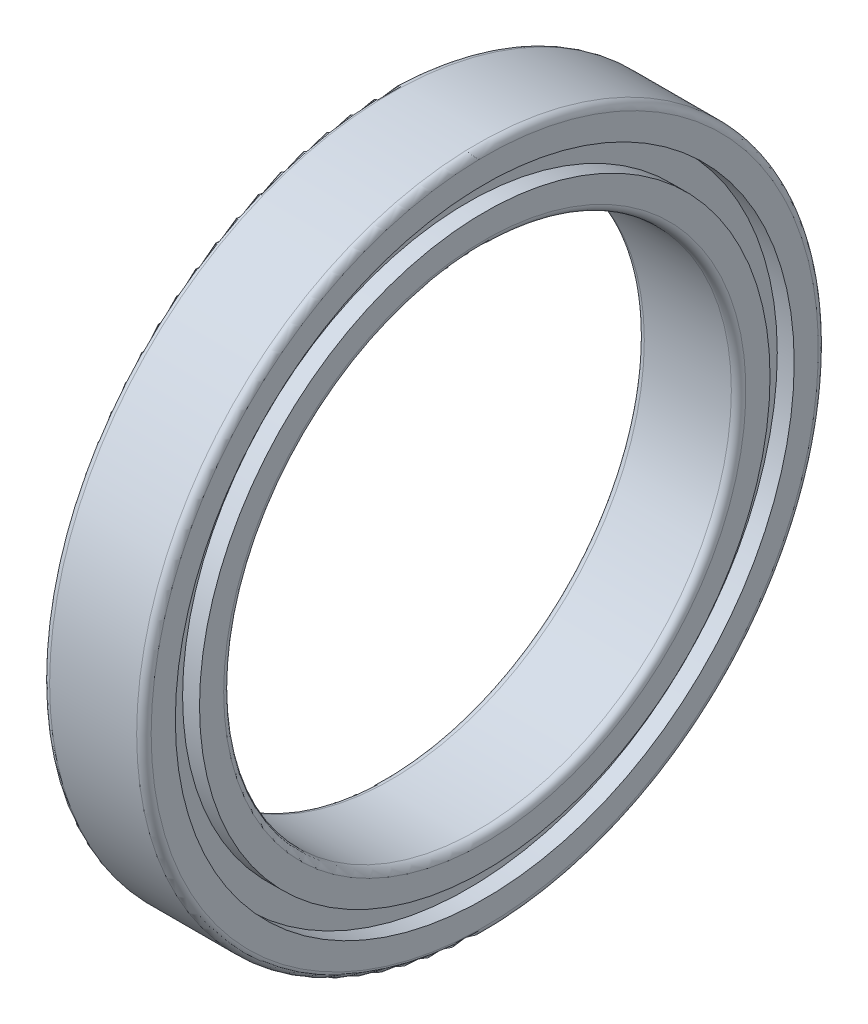
ISO-10303-21;
HEADER;
FILE_DESCRIPTION(('STEP AP214'),'2;1');
FILE_NAME('part.step','',(''),(''),'','','');
FILE_SCHEMA(('AUTOMOTIVE_DESIGN { 1 0 10303 214 1 1 1 1 }'));
ENDSEC;
DATA;
#1=APPLICATION_CONTEXT('core data for automotive mechanical design processes');
#2=APPLICATION_PROTOCOL_DEFINITION('international standard','automotive_design',2000,#1);
#3=PRODUCT_CONTEXT('',#1,'mechanical');
#4=PRODUCT('Part','Part','',(#3));
#5=PRODUCT_RELATED_PRODUCT_CATEGORY('part','',(#4));
#6=PRODUCT_DEFINITION_FORMATION('','',#4);
#7=PRODUCT_DEFINITION_CONTEXT('part definition',#1,'design');
#8=PRODUCT_DEFINITION('design','',#6,#7);
#9=PRODUCT_DEFINITION_SHAPE('','',#8);
#10=(LENGTH_UNIT() NAMED_UNIT(*) SI_UNIT(.MILLI.,.METRE.));
#11=(NAMED_UNIT(*) PLANE_ANGLE_UNIT() SI_UNIT($,.RADIAN.));
#12=(NAMED_UNIT(*) SI_UNIT($,.STERADIAN.) SOLID_ANGLE_UNIT());
#13=UNCERTAINTY_MEASURE_WITH_UNIT(LENGTH_MEASURE(1.E-05),#10,'distance_accuracy_value','');
#14=(GEOMETRIC_REPRESENTATION_CONTEXT(3) GLOBAL_UNCERTAINTY_ASSIGNED_CONTEXT((#13)) GLOBAL_UNIT_ASSIGNED_CONTEXT((#10,
#11,#12)) REPRESENTATION_CONTEXT('',''));
#15=CARTESIAN_POINT('',(0.,0.,0.));
#16=DIRECTION('',(0.,0.,1.));
#17=DIRECTION('',(1.,0.,0.));
#18=AXIS2_PLACEMENT_3D('',#15,#16,#17);
#19=CARTESIAN_POINT('',(-3.,0.,0.));
#20=DIRECTION('',(-1.,0.,0.));
#21=DIRECTION('',(0.,0.,1.));
#22=AXIS2_PLACEMENT_3D('',#19,#20,#21);
#23=TOROIDAL_SURFACE('',#22,18.,0.5);
#24=CARTESIAN_POINT('',(-3.,0.,0.));
#25=DIRECTION('',(-1.,0.,0.));
#26=DIRECTION('',(0.,0.,1.));
#27=AXIS2_PLACEMENT_3D('',#24,#25,#26);
#28=CIRCLE('',#27,17.5);
#29=CARTESIAN_POINT('',(-3.,0.,17.5));
#30=VERTEX_POINT('',#29);
#31=EDGE_CURVE('E94',#30,#30,#28,.T.);
#32=ORIENTED_EDGE('',*,*,#31,.F.);
#33=EDGE_LOOP('',(#32));
#34=FACE_BOUND('',#33,.T.);
#35=CARTESIAN_POINT('',(-3.49999999999995,0.,0.));
#36=DIRECTION('',(-1.,0.,0.));
#37=DIRECTION('',(0.,0.,1.));
#38=AXIS2_PLACEMENT_3D('',#35,#36,#37);
#39=CIRCLE('',#38,18.);
#40=CARTESIAN_POINT('',(-3.49999999999995,0.,18.));
#41=VERTEX_POINT('',#40);
#42=EDGE_CURVE('E12',#41,#41,#39,.T.);
#43=ORIENTED_EDGE('',*,*,#42,.T.);
#44=EDGE_LOOP('',(#43));
#45=FACE_BOUND('',#44,.T.);
#46=ADVANCED_FACE('F42',(#34,#45),#23,.T.);
#47=CARTESIAN_POINT('',(-3.5,18.,0.));
#48=DIRECTION('',(1.,0.,0.));
#49=DIRECTION('',(0.,0.,-1.));
#50=AXIS2_PLACEMENT_3D('',#47,#48,#49);
#51=PLANE('',#50);
#52=ORIENTED_EDGE('',*,*,#42,.F.);
#53=EDGE_LOOP('',(#52));
#54=FACE_BOUND('',#53,.T.);
#55=CARTESIAN_POINT('',(-3.49999999999995,0.,0.));
#56=DIRECTION('',(-1.,0.,0.));
#57=DIRECTION('',(0.,0.,1.));
#58=AXIS2_PLACEMENT_3D('',#55,#56,#57);
#59=CIRCLE('',#58,19.6666666666667);
#60=CARTESIAN_POINT('',(-3.49999999999995,0.,19.6666666666667));
#61=VERTEX_POINT('',#60);
#62=EDGE_CURVE('E48',#61,#61,#59,.T.);
#63=ORIENTED_EDGE('',*,*,#62,.T.);
#64=EDGE_LOOP('',(#63));
#65=FACE_BOUND('',#64,.T.);
#66=ADVANCED_FACE('F101',(#54,#65),#51,.F.);
#67=CARTESIAN_POINT('',(-1000.,0.,0.));
#68=DIRECTION('',(-1.,0.,0.));
#69=DIRECTION('',(0.,0.,1.));
#70=AXIS2_PLACEMENT_3D('',#67,#68,#69);
#71=CYLINDRICAL_SURFACE('',#70,19.6666666666667);
#72=ORIENTED_EDGE('',*,*,#62,.F.);
#73=EDGE_LOOP('',(#72));
#74=FACE_BOUND('',#73,.T.);
#75=CARTESIAN_POINT('',(-2.3333333333333,0.,0.));
#76=DIRECTION('',(-1.,0.,0.));
#77=DIRECTION('',(0.,0.,1.));
#78=AXIS2_PLACEMENT_3D('',#75,#76,#77);
#79=CIRCLE('',#78,19.6666666666667);
#80=CARTESIAN_POINT('',(-2.3333333333333,0.,19.6666666666667));
#81=VERTEX_POINT('',#80);
#82=EDGE_CURVE('E52',#81,#81,#79,.T.);
#83=ORIENTED_EDGE('',*,*,#82,.T.);
#84=EDGE_LOOP('',(#83));
#85=FACE_BOUND('',#84,.T.);
#86=ADVANCED_FACE('F105',(#74,#85),#71,.T.);
#87=CARTESIAN_POINT('',(-2.33333333333333,19.6666666666667,0.));
#88=DIRECTION('',(1.,0.,0.));
#89=DIRECTION('',(0.,0.,-1.));
#90=AXIS2_PLACEMENT_3D('',#87,#88,#89);
#91=PLANE('',#90);
#92=ORIENTED_EDGE('',*,*,#82,.F.);
#93=EDGE_LOOP('',(#92));
#94=FACE_BOUND('',#93,.T.);
#95=CARTESIAN_POINT('',(-2.3333333333333,0.,0.));
#96=DIRECTION('',(-1.,0.,0.));
#97=DIRECTION('',(0.,0.,1.));
#98=AXIS2_PLACEMENT_3D('',#95,#96,#97);
#99=CIRCLE('',#98,21.3333333333333);
#100=CARTESIAN_POINT('',(-2.3333333333333,0.,21.3333333333333));
#101=VERTEX_POINT('',#100);
#102=EDGE_CURVE('E56',#101,#101,#99,.T.);
#103=ORIENTED_EDGE('',*,*,#102,.T.);
#104=EDGE_LOOP('',(#103));
#105=FACE_BOUND('',#104,.T.);
#106=ADVANCED_FACE('F110',(#94,#105),#91,.F.);
#107=CARTESIAN_POINT('',(-1000.,0.,0.));
#108=DIRECTION('',(-1.,0.,0.));
#109=DIRECTION('',(0.,0.,1.));
#110=AXIS2_PLACEMENT_3D('',#107,#108,#109);
#111=CYLINDRICAL_SURFACE('',#110,21.3333333333333);
#112=ORIENTED_EDGE('',*,*,#102,.F.);
#113=EDGE_LOOP('',(#112));
#114=FACE_BOUND('',#113,.T.);
#115=CARTESIAN_POINT('',(-3.49999999999995,0.,0.));
#116=DIRECTION('',(-1.,0.,0.));
#117=DIRECTION('',(0.,0.,1.));
#118=AXIS2_PLACEMENT_3D('',#115,#116,#117);
#119=CIRCLE('',#118,21.3333333333333);
#120=CARTESIAN_POINT('',(-3.49999999999995,0.,21.3333333333333));
#121=VERTEX_POINT('',#120);
#122=EDGE_CURVE('E61',#121,#121,#119,.T.);
#123=ORIENTED_EDGE('',*,*,#122,.T.);
#124=EDGE_LOOP('',(#123));
#125=FACE_BOUND('',#124,.T.);
#126=ADVANCED_FACE('F116',(#114,#125),#111,.F.);
#127=CARTESIAN_POINT('',(-3.5,21.3333333333333,0.));
#128=DIRECTION('',(1.,0.,0.));
#129=DIRECTION('',(0.,0.,-1.));
#130=AXIS2_PLACEMENT_3D('',#127,#128,#129);
#131=PLANE('',#130);
#132=ORIENTED_EDGE('',*,*,#122,.F.);
#133=EDGE_LOOP('',(#132));
#134=FACE_BOUND('',#133,.T.);
#135=CARTESIAN_POINT('',(-3.49999999999995,0.,0.));
#136=DIRECTION('',(-1.,0.,0.));
#137=DIRECTION('',(0.,0.,1.));
#138=AXIS2_PLACEMENT_3D('',#135,#136,#137);
#139=CIRCLE('',#138,23.);
#140=CARTESIAN_POINT('',(-3.49999999999995,0.,23.));
#141=VERTEX_POINT('',#140);
#142=EDGE_CURVE('E64',#141,#141,#139,.T.);
#143=ORIENTED_EDGE('',*,*,#142,.T.);
#144=EDGE_LOOP('',(#143));
#145=FACE_BOUND('',#144,.T.);
#146=ADVANCED_FACE('F120',(#134,#145),#131,.F.);
#147=CARTESIAN_POINT('',(-3.,0.,0.));
#148=DIRECTION('',(-1.,0.,0.));
#149=DIRECTION('',(0.,0.,1.));
#150=AXIS2_PLACEMENT_3D('',#147,#148,#149);
#151=TOROIDAL_SURFACE('',#150,23.,0.5);
#152=ORIENTED_EDGE('',*,*,#142,.F.);
#153=EDGE_LOOP('',(#152));
#154=FACE_BOUND('',#153,.T.);
#155=CARTESIAN_POINT('',(-3.,0.,0.));
#156=DIRECTION('',(-1.,0.,0.));
#157=DIRECTION('',(0.,0.,1.));
#158=AXIS2_PLACEMENT_3D('',#155,#156,#157);
#159=CIRCLE('',#158,23.5);
#160=CARTESIAN_POINT('',(-3.,0.,23.5));
#161=VERTEX_POINT('',#160);
#162=EDGE_CURVE('E67',#161,#161,#159,.T.);
#163=ORIENTED_EDGE('',*,*,#162,.T.);
#164=EDGE_LOOP('',(#163));
#165=FACE_BOUND('',#164,.T.);
#166=ADVANCED_FACE('F124',(#154,#165),#151,.T.);
#167=CARTESIAN_POINT('',(-1000.,0.,0.));
#168=DIRECTION('',(-1.,0.,0.));
#169=DIRECTION('',(0.,0.,1.));
#170=AXIS2_PLACEMENT_3D('',#167,#168,#169);
#171=CYLINDRICAL_SURFACE('',#170,23.5);
#172=ORIENTED_EDGE('',*,*,#162,.F.);
#173=EDGE_LOOP('',(#172));
#174=FACE_BOUND('',#173,.T.);
#175=CARTESIAN_POINT('',(2.99999999999989,0.,0.));
#176=DIRECTION('',(-1.,0.,0.));
#177=DIRECTION('',(0.,0.,1.));
#178=AXIS2_PLACEMENT_3D('',#175,#176,#177);
#179=CIRCLE('',#178,23.5);
#180=CARTESIAN_POINT('',(2.99999999999989,0.,23.5));
#181=VERTEX_POINT('',#180);
#182=EDGE_CURVE('E70',#181,#181,#179,.T.);
#183=ORIENTED_EDGE('',*,*,#182,.T.);
#184=EDGE_LOOP('',(#183));
#185=FACE_BOUND('',#184,.T.);
#186=ADVANCED_FACE('F128',(#174,#185),#171,.T.);
#187=CARTESIAN_POINT('',(3.,0.,0.));
#188=DIRECTION('',(-1.,0.,0.));
#189=DIRECTION('',(0.,0.,1.));
#190=AXIS2_PLACEMENT_3D('',#187,#188,#189);
#191=TOROIDAL_SURFACE('',#190,23.,0.5);
#192=ORIENTED_EDGE('',*,*,#182,.F.);
#193=EDGE_LOOP('',(#192));
#194=FACE_BOUND('',#193,.T.);
#195=CARTESIAN_POINT('',(3.50000000000006,0.,0.));
#196=DIRECTION('',(-1.,0.,0.));
#197=DIRECTION('',(0.,0.,1.));
#198=AXIS2_PLACEMENT_3D('',#195,#196,#197);
#199=CIRCLE('',#198,23.);
#200=CARTESIAN_POINT('',(3.50000000000006,0.,23.));
#201=VERTEX_POINT('',#200);
#202=EDGE_CURVE('E73',#201,#201,#199,.T.);
#203=ORIENTED_EDGE('',*,*,#202,.T.);
#204=EDGE_LOOP('',(#203));
#205=FACE_BOUND('',#204,.T.);
#206=ADVANCED_FACE('F132',(#194,#205),#191,.T.);
#207=CARTESIAN_POINT('',(3.5,21.3333333333333,0.));
#208=DIRECTION('',(-1.,0.,0.));
#209=DIRECTION('',(0.,0.,1.));
#210=AXIS2_PLACEMENT_3D('',#207,#208,#209);
#211=PLANE('',#210);
#212=ORIENTED_EDGE('',*,*,#202,.F.);
#213=EDGE_LOOP('',(#212));
#214=FACE_BOUND('',#213,.T.);
#215=CARTESIAN_POINT('',(3.50000000000006,0.,0.));
#216=DIRECTION('',(-1.,0.,0.));
#217=DIRECTION('',(0.,0.,1.));
#218=AXIS2_PLACEMENT_3D('',#215,#216,#217);
#219=CIRCLE('',#218,21.3333333333333);
#220=CARTESIAN_POINT('',(3.50000000000006,0.,21.3333333333333));
#221=VERTEX_POINT('',#220);
#222=EDGE_CURVE('E76',#221,#221,#219,.T.);
#223=ORIENTED_EDGE('',*,*,#222,.T.);
#224=EDGE_LOOP('',(#223));
#225=FACE_BOUND('',#224,.T.);
#226=ADVANCED_FACE('F136',(#214,#225),#211,.F.);
#227=CARTESIAN_POINT('',(-1000.,0.,0.));
#228=DIRECTION('',(-1.,0.,0.));
#229=DIRECTION('',(0.,0.,1.));
#230=AXIS2_PLACEMENT_3D('',#227,#228,#229);
#231=CYLINDRICAL_SURFACE('',#230,21.3333333333333);
#232=ORIENTED_EDGE('',*,*,#222,.F.);
#233=EDGE_LOOP('',(#232));
#234=FACE_BOUND('',#233,.T.);
#235=CARTESIAN_POINT('',(2.3333333333333,0.,0.));
#236=DIRECTION('',(-1.,0.,0.));
#237=DIRECTION('',(0.,0.,1.));
#238=AXIS2_PLACEMENT_3D('',#235,#236,#237);
#239=CIRCLE('',#238,21.3333333333333);
#240=CARTESIAN_POINT('',(2.3333333333333,0.,21.3333333333333));
#241=VERTEX_POINT('',#240);
#242=EDGE_CURVE('E79',#241,#241,#239,.T.);
#243=ORIENTED_EDGE('',*,*,#242,.T.);
#244=EDGE_LOOP('',(#243));
#245=FACE_BOUND('',#244,.T.);
#246=ADVANCED_FACE('F140',(#234,#245),#231,.F.);
#247=CARTESIAN_POINT('',(2.33333333333333,19.6666666666667,0.));
#248=DIRECTION('',(-1.,0.,0.));
#249=DIRECTION('',(0.,0.,1.));
#250=AXIS2_PLACEMENT_3D('',#247,#248,#249);
#251=PLANE('',#250);
#252=ORIENTED_EDGE('',*,*,#242,.F.);
#253=EDGE_LOOP('',(#252));
#254=FACE_BOUND('',#253,.T.);
#255=CARTESIAN_POINT('',(2.3333333333333,0.,0.));
#256=DIRECTION('',(-1.,0.,0.));
#257=DIRECTION('',(0.,0.,1.));
#258=AXIS2_PLACEMENT_3D('',#255,#256,#257);
#259=CIRCLE('',#258,19.6666666666667);
#260=CARTESIAN_POINT('',(2.3333333333333,0.,19.6666666666667));
#261=VERTEX_POINT('',#260);
#262=EDGE_CURVE('E82',#261,#261,#259,.T.);
#263=ORIENTED_EDGE('',*,*,#262,.T.);
#264=EDGE_LOOP('',(#263));
#265=FACE_BOUND('',#264,.T.);
#266=ADVANCED_FACE('F144',(#254,#265),#251,.F.);
#267=CARTESIAN_POINT('',(-1000.,0.,0.));
#268=DIRECTION('',(-1.,0.,0.));
#269=DIRECTION('',(0.,0.,1.));
#270=AXIS2_PLACEMENT_3D('',#267,#268,#269);
#271=CYLINDRICAL_SURFACE('',#270,19.6666666666667);
#272=ORIENTED_EDGE('',*,*,#262,.F.);
#273=EDGE_LOOP('',(#272));
#274=FACE_BOUND('',#273,.T.);
#275=CARTESIAN_POINT('',(3.50000000000006,0.,0.));
#276=DIRECTION('',(-1.,0.,0.));
#277=DIRECTION('',(0.,0.,1.));
#278=AXIS2_PLACEMENT_3D('',#275,#276,#277);
#279=CIRCLE('',#278,19.6666666666667);
#280=CARTESIAN_POINT('',(3.50000000000006,0.,19.6666666666667));
#281=VERTEX_POINT('',#280);
#282=EDGE_CURVE('E85',#281,#281,#279,.T.);
#283=ORIENTED_EDGE('',*,*,#282,.T.);
#284=EDGE_LOOP('',(#283));
#285=FACE_BOUND('',#284,.T.);
#286=ADVANCED_FACE('F148',(#274,#285),#271,.T.);
#287=CARTESIAN_POINT('',(3.5,18.,0.));
#288=DIRECTION('',(-1.,0.,0.));
#289=DIRECTION('',(0.,0.,1.));
#290=AXIS2_PLACEMENT_3D('',#287,#288,#289);
#291=PLANE('',#290);
#292=ORIENTED_EDGE('',*,*,#282,.F.);
#293=EDGE_LOOP('',(#292));
#294=FACE_BOUND('',#293,.T.);
#295=CARTESIAN_POINT('',(3.50000000000006,0.,0.));
#296=DIRECTION('',(-1.,0.,0.));
#297=DIRECTION('',(0.,0.,1.));
#298=AXIS2_PLACEMENT_3D('',#295,#296,#297);
#299=CIRCLE('',#298,18.);
#300=CARTESIAN_POINT('',(3.50000000000006,0.,18.));
#301=VERTEX_POINT('',#300);
#302=EDGE_CURVE('E88',#301,#301,#299,.T.);
#303=ORIENTED_EDGE('',*,*,#302,.T.);
#304=EDGE_LOOP('',(#303));
#305=FACE_BOUND('',#304,.T.);
#306=ADVANCED_FACE('F152',(#294,#305),#291,.F.);
#307=CARTESIAN_POINT('',(3.,0.,0.));
#308=DIRECTION('',(-1.,0.,0.));
#309=DIRECTION('',(0.,0.,1.));
#310=AXIS2_PLACEMENT_3D('',#307,#308,#309);
#311=TOROIDAL_SURFACE('',#310,18.,0.5);
#312=ORIENTED_EDGE('',*,*,#302,.F.);
#313=EDGE_LOOP('',(#312));
#314=FACE_BOUND('',#313,.T.);
#315=CARTESIAN_POINT('',(2.99999999999989,0.,0.));
#316=DIRECTION('',(-1.,0.,0.));
#317=DIRECTION('',(0.,0.,1.));
#318=AXIS2_PLACEMENT_3D('',#315,#316,#317);
#319=CIRCLE('',#318,17.5);
#320=CARTESIAN_POINT('',(2.99999999999989,0.,17.5));
#321=VERTEX_POINT('',#320);
#322=EDGE_CURVE('E91',#321,#321,#319,.T.);
#323=ORIENTED_EDGE('',*,*,#322,.T.);
#324=EDGE_LOOP('',(#323));
#325=FACE_BOUND('',#324,.T.);
#326=ADVANCED_FACE('F156',(#314,#325),#311,.T.);
#327=CARTESIAN_POINT('',(-1000.,0.,0.));
#328=DIRECTION('',(-1.,0.,0.));
#329=DIRECTION('',(0.,0.,1.));
#330=AXIS2_PLACEMENT_3D('',#327,#328,#329);
#331=CYLINDRICAL_SURFACE('',#330,17.5);
#332=ORIENTED_EDGE('',*,*,#322,.F.);
#333=EDGE_LOOP('',(#332));
#334=FACE_BOUND('',#333,.T.);
#335=ORIENTED_EDGE('',*,*,#31,.T.);
#336=EDGE_LOOP('',(#335));
#337=FACE_BOUND('',#336,.T.);
#338=ADVANCED_FACE('F98',(#334,#337),#331,.F.);
#339=CLOSED_SHELL('',(#46,#66,#86,#106,#126,#146,#166,#186,#206,#226,#246,#266,#286,#306,#326,#338));
#340=MANIFOLD_SOLID_BREP('B2',#339);
#341=ADVANCED_BREP_SHAPE_REPRESENTATION('',(#18,#340),#14);
#342=SHAPE_DEFINITION_REPRESENTATION(#9,#341);
ENDSEC;
END-ISO-10303-21;
